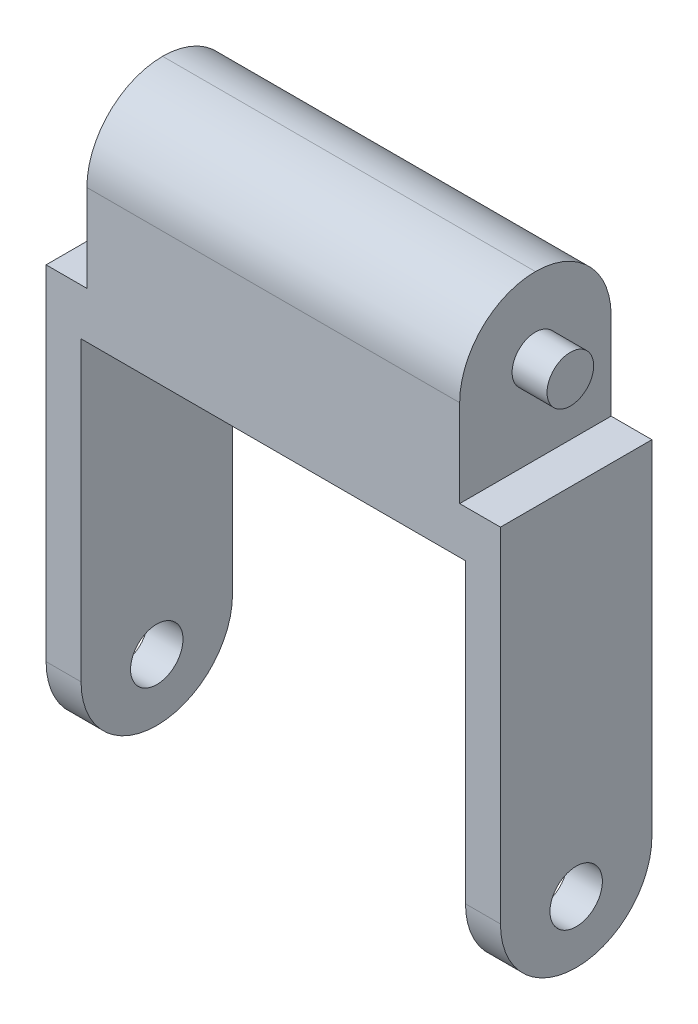
ISO-10303-21;
HEADER;
FILE_DESCRIPTION(('STEP AP214'),'2;1');
FILE_NAME('part.step','',(''),(''),'','','');
FILE_SCHEMA(('AUTOMOTIVE_DESIGN { 1 0 10303 214 1 1 1 1 }'));
ENDSEC;
DATA;
#1=APPLICATION_CONTEXT('core data for automotive mechanical design processes');
#2=APPLICATION_PROTOCOL_DEFINITION('international standard','automotive_design',2000,#1);
#3=PRODUCT_CONTEXT('',#1,'mechanical');
#4=PRODUCT('Part','Part','',(#3));
#5=PRODUCT_RELATED_PRODUCT_CATEGORY('part','',(#4));
#6=PRODUCT_DEFINITION_FORMATION('','',#4);
#7=PRODUCT_DEFINITION_CONTEXT('part definition',#1,'design');
#8=PRODUCT_DEFINITION('design','',#6,#7);
#9=PRODUCT_DEFINITION_SHAPE('','',#8);
#10=(LENGTH_UNIT() NAMED_UNIT(*) SI_UNIT(.MILLI.,.METRE.));
#11=(NAMED_UNIT(*) PLANE_ANGLE_UNIT() SI_UNIT($,.RADIAN.));
#12=(NAMED_UNIT(*) SI_UNIT($,.STERADIAN.) SOLID_ANGLE_UNIT());
#13=UNCERTAINTY_MEASURE_WITH_UNIT(LENGTH_MEASURE(1.E-05),#10,'distance_accuracy_value','');
#14=(GEOMETRIC_REPRESENTATION_CONTEXT(3) GLOBAL_UNCERTAINTY_ASSIGNED_CONTEXT((#13)) GLOBAL_UNIT_ASSIGNED_CONTEXT((#10,
#11,#12)) REPRESENTATION_CONTEXT('',''));
#15=CARTESIAN_POINT('',(0.,0.,0.));
#16=DIRECTION('',(0.,0.,1.));
#17=DIRECTION('',(1.,0.,0.));
#18=AXIS2_PLACEMENT_3D('',#15,#16,#17);
#19=CARTESIAN_POINT('',(0.,0.,13.));
#20=DIRECTION('',(1.,0.,0.));
#21=DIRECTION('',(0.,0.,-1.));
#22=AXIS2_PLACEMENT_3D('',#19,#20,#21);
#23=PLANE('',#22);
#24=CARTESIAN_POINT('',(0.,5.29398853892159,6.5));
#25=DIRECTION('',(-1.,0.,0.));
#26=DIRECTION('',(0.,0.,1.));
#27=AXIS2_PLACEMENT_3D('',#24,#25,#26);
#28=CIRCLE('',#27,2.25);
#29=CARTESIAN_POINT('',(0.,5.29398853892159,8.75));
#30=VERTEX_POINT('',#29);
#31=EDGE_CURVE('E346',#30,#30,#28,.T.);
#32=ORIENTED_EDGE('',*,*,#31,.F.);
#33=EDGE_LOOP('',(#32));
#34=FACE_BOUND('',#33,.T.);
#35=DIRECTION('',(0.,-1.,0.));
#36=VECTOR('',#35,1.);
#37=CARTESIAN_POINT('',(0.,0.,0.));
#38=LINE('',#37,#36);
#39=CARTESIAN_POINT('',(0.,36.,0.));
#40=VERTEX_POINT('',#39);
#41=CARTESIAN_POINT('',(0.,6.5,0.));
#42=VERTEX_POINT('',#41);
#43=EDGE_CURVE('E184',#40,#42,#38,.T.);
#44=ORIENTED_EDGE('',*,*,#43,.T.);
#45=CARTESIAN_POINT('',(0.,6.5,6.5));
#46=DIRECTION('',(1.,0.,0.));
#47=DIRECTION('',(0.,0.,-1.));
#48=AXIS2_PLACEMENT_3D('',#45,#46,#47);
#49=CIRCLE('',#48,6.5);
#50=CARTESIAN_POINT('',(0.,0.,6.5));
#51=VERTEX_POINT('',#50);
#52=EDGE_CURVE('E233',#42,#51,#49,.F.);
#53=ORIENTED_EDGE('',*,*,#52,.T.);
#54=CARTESIAN_POINT('',(0.,6.5,6.5));
#55=DIRECTION('',(1.,0.,0.));
#56=DIRECTION('',(0.,0.,-1.));
#57=AXIS2_PLACEMENT_3D('',#54,#55,#56);
#58=CIRCLE('',#57,6.5);
#59=CARTESIAN_POINT('',(0.,6.5,13.));
#60=VERTEX_POINT('',#59);
#61=EDGE_CURVE('E231',#51,#60,#58,.F.);
#62=ORIENTED_EDGE('',*,*,#61,.T.);
#63=DIRECTION('',(0.,-1.,0.));
#64=VECTOR('',#63,1.);
#65=CARTESIAN_POINT('',(0.,0.,13.));
#66=LINE('',#65,#64);
#67=CARTESIAN_POINT('',(0.,36.,13.));
#68=VERTEX_POINT('',#67);
#69=EDGE_CURVE('E153',#68,#60,#66,.T.);
#70=ORIENTED_EDGE('',*,*,#69,.F.);
#71=DIRECTION('',(0.,0.,-1.));
#72=VECTOR('',#71,1.);
#73=CARTESIAN_POINT('',(0.,36.,13.));
#74=LINE('',#73,#72);
#75=EDGE_CURVE('E183',#68,#40,#74,.T.);
#76=ORIENTED_EDGE('',*,*,#75,.T.);
#77=EDGE_LOOP('',(#44,#53,#62,#70,#76));
#78=FACE_BOUND('',#77,.T.);
#79=ADVANCED_FACE('F33',(#34,#78),#23,.F.);
#80=CARTESIAN_POINT('',(3.,0.,13.));
#81=DIRECTION('',(-1.,0.,0.));
#82=DIRECTION('',(0.,0.,1.));
#83=AXIS2_PLACEMENT_3D('',#80,#81,#82);
#84=PLANE('',#83);
#85=CARTESIAN_POINT('',(3.,5.29398853892159,6.5));
#86=DIRECTION('',(-1.,0.,0.));
#87=DIRECTION('',(0.,0.,1.));
#88=AXIS2_PLACEMENT_3D('',#85,#86,#87);
#89=CIRCLE('',#88,2.25);
#90=CARTESIAN_POINT('',(3.,5.29398853892159,8.75));
#91=VERTEX_POINT('',#90);
#92=EDGE_CURVE('E187',#91,#91,#89,.T.);
#93=ORIENTED_EDGE('',*,*,#92,.T.);
#94=EDGE_LOOP('',(#93));
#95=FACE_BOUND('',#94,.T.);
#96=CARTESIAN_POINT('',(3.,6.5,6.5));
#97=DIRECTION('',(-1.,0.,0.));
#98=DIRECTION('',(0.,0.,1.));
#99=AXIS2_PLACEMENT_3D('',#96,#97,#98);
#100=CIRCLE('',#99,6.5);
#101=CARTESIAN_POINT('',(3.,6.5,13.));
#102=VERTEX_POINT('',#101);
#103=CARTESIAN_POINT('',(3.,0.,6.5));
#104=VERTEX_POINT('',#103);
#105=EDGE_CURVE('E221',#102,#104,#100,.F.);
#106=ORIENTED_EDGE('',*,*,#105,.T.);
#107=CARTESIAN_POINT('',(3.,6.5,6.5));
#108=DIRECTION('',(-1.,0.,0.));
#109=DIRECTION('',(0.,0.,1.));
#110=AXIS2_PLACEMENT_3D('',#107,#108,#109);
#111=CIRCLE('',#110,6.5);
#112=CARTESIAN_POINT('',(3.,6.5,0.));
#113=VERTEX_POINT('',#112);
#114=EDGE_CURVE('E223',#104,#113,#111,.F.);
#115=ORIENTED_EDGE('',*,*,#114,.T.);
#116=DIRECTION('',(0.,1.,0.));
#117=VECTOR('',#116,1.);
#118=CARTESIAN_POINT('',(3.,0.,0.));
#119=LINE('',#118,#117);
#120=CARTESIAN_POINT('',(3.,32.,0.));
#121=VERTEX_POINT('',#120);
#122=EDGE_CURVE('E159',#113,#121,#119,.T.);
#123=ORIENTED_EDGE('',*,*,#122,.T.);
#124=DIRECTION('',(0.,0.,-1.));
#125=VECTOR('',#124,1.);
#126=CARTESIAN_POINT('',(3.,32.,13.));
#127=LINE('',#126,#125);
#128=CARTESIAN_POINT('',(3.,32.,13.));
#129=VERTEX_POINT('',#128);
#130=EDGE_CURVE('E156',#129,#121,#127,.T.);
#131=ORIENTED_EDGE('',*,*,#130,.F.);
#132=DIRECTION('',(0.,1.,0.));
#133=VECTOR('',#132,1.);
#134=CARTESIAN_POINT('',(3.,0.,13.));
#135=LINE('',#134,#133);
#136=EDGE_CURVE('E140',#102,#129,#135,.T.);
#137=ORIENTED_EDGE('',*,*,#136,.F.);
#138=EDGE_LOOP('',(#106,#115,#123,#131,#137));
#139=FACE_BOUND('',#138,.T.);
#140=ADVANCED_FACE('F157',(#95,#139),#84,.F.);
#141=CARTESIAN_POINT('',(3.,32.,13.));
#142=DIRECTION('',(0.,1.,0.));
#143=DIRECTION('',(0.,0.,1.));
#144=AXIS2_PLACEMENT_3D('',#141,#142,#143);
#145=PLANE('',#144);
#146=DIRECTION('',(1.,0.,0.));
#147=VECTOR('',#146,1.);
#148=CARTESIAN_POINT('',(3.,32.,0.));
#149=LINE('',#148,#147);
#150=CARTESIAN_POINT('',(36.,32.,0.));
#151=VERTEX_POINT('',#150);
#152=EDGE_CURVE('E189',#121,#151,#149,.T.);
#153=ORIENTED_EDGE('',*,*,#152,.T.);
#154=DIRECTION('',(0.,0.,-1.));
#155=VECTOR('',#154,1.);
#156=CARTESIAN_POINT('',(36.,32.,13.));
#157=LINE('',#156,#155);
#158=CARTESIAN_POINT('',(36.,32.,13.));
#159=VERTEX_POINT('',#158);
#160=EDGE_CURVE('E163',#159,#151,#157,.T.);
#161=ORIENTED_EDGE('',*,*,#160,.F.);
#162=DIRECTION('',(1.,0.,0.));
#163=VECTOR('',#162,1.);
#164=CARTESIAN_POINT('',(3.,32.,13.));
#165=LINE('',#164,#163);
#166=EDGE_CURVE('E146',#129,#159,#165,.T.);
#167=ORIENTED_EDGE('',*,*,#166,.F.);
#168=ORIENTED_EDGE('',*,*,#130,.T.);
#169=EDGE_LOOP('',(#153,#161,#167,#168));
#170=FACE_BOUND('',#169,.T.);
#171=ADVANCED_FACE('F165',(#170),#145,.F.);
#172=CARTESIAN_POINT('',(36.,32.,13.));
#173=DIRECTION('',(1.,0.,0.));
#174=DIRECTION('',(0.,1.,0.));
#175=AXIS2_PLACEMENT_3D('',#172,#173,#174);
#176=PLANE('',#175);
#177=CARTESIAN_POINT('',(36.,5.29398853892159,6.5));
#178=DIRECTION('',(1.,0.,0.));
#179=DIRECTION('',(0.,1.,0.));
#180=AXIS2_PLACEMENT_3D('',#177,#178,#179);
#181=CIRCLE('',#180,2.25);
#182=CARTESIAN_POINT('',(36.,7.54398853892159,6.5));
#183=VERTEX_POINT('',#182);
#184=EDGE_CURVE('E342',#183,#183,#181,.T.);
#185=ORIENTED_EDGE('',*,*,#184,.T.);
#186=EDGE_LOOP('',(#185));
#187=FACE_BOUND('',#186,.T.);
#188=DIRECTION('',(0.,-1.,0.));
#189=VECTOR('',#188,1.);
#190=CARTESIAN_POINT('',(36.,32.,0.));
#191=LINE('',#190,#189);
#192=CARTESIAN_POINT('',(36.,6.5,0.));
#193=VERTEX_POINT('',#192);
#194=EDGE_CURVE('E191',#151,#193,#191,.T.);
#195=ORIENTED_EDGE('',*,*,#194,.T.);
#196=CARTESIAN_POINT('',(36.,6.5,6.5));
#197=DIRECTION('',(1.,0.,0.));
#198=DIRECTION('',(0.,1.,0.));
#199=AXIS2_PLACEMENT_3D('',#196,#197,#198);
#200=CIRCLE('',#199,6.5);
#201=CARTESIAN_POINT('',(36.,0.,6.5));
#202=VERTEX_POINT('',#201);
#203=EDGE_CURVE('E244',#193,#202,#200,.F.);
#204=ORIENTED_EDGE('',*,*,#203,.T.);
#205=CARTESIAN_POINT('',(36.,6.5,6.5));
#206=DIRECTION('',(1.,0.,0.));
#207=DIRECTION('',(0.,1.,0.));
#208=AXIS2_PLACEMENT_3D('',#205,#206,#207);
#209=CIRCLE('',#208,6.5);
#210=CARTESIAN_POINT('',(36.,6.5,13.));
#211=VERTEX_POINT('',#210);
#212=EDGE_CURVE('E242',#202,#211,#209,.F.);
#213=ORIENTED_EDGE('',*,*,#212,.T.);
#214=DIRECTION('',(0.,-1.,0.));
#215=VECTOR('',#214,1.);
#216=CARTESIAN_POINT('',(36.,32.,13.));
#217=LINE('',#216,#215);
#218=EDGE_CURVE('E168',#159,#211,#217,.T.);
#219=ORIENTED_EDGE('',*,*,#218,.F.);
#220=ORIENTED_EDGE('',*,*,#160,.T.);
#221=EDGE_LOOP('',(#195,#204,#213,#219,#220));
#222=FACE_BOUND('',#221,.T.);
#223=ADVANCED_FACE('F327',(#187,#222),#176,.F.);
#224=CARTESIAN_POINT('',(39.,0.,13.));
#225=DIRECTION('',(-1.,0.,0.));
#226=DIRECTION('',(0.,0.,1.));
#227=AXIS2_PLACEMENT_3D('',#224,#225,#226);
#228=PLANE('',#227);
#229=CARTESIAN_POINT('',(39.,5.29398853892159,6.5));
#230=DIRECTION('',(-1.,0.,0.));
#231=DIRECTION('',(0.,0.,1.));
#232=AXIS2_PLACEMENT_3D('',#229,#230,#231);
#233=CIRCLE('',#232,2.25);
#234=CARTESIAN_POINT('',(39.,5.29398853892159,8.75));
#235=VERTEX_POINT('',#234);
#236=EDGE_CURVE('E345',#235,#235,#233,.T.);
#237=ORIENTED_EDGE('',*,*,#236,.T.);
#238=EDGE_LOOP('',(#237));
#239=FACE_BOUND('',#238,.T.);
#240=CARTESIAN_POINT('',(39.,6.5,6.5));
#241=DIRECTION('',(-1.,0.,0.));
#242=DIRECTION('',(0.,0.,1.));
#243=AXIS2_PLACEMENT_3D('',#240,#241,#242);
#244=CIRCLE('',#243,6.5);
#245=CARTESIAN_POINT('',(39.,6.5,13.));
#246=VERTEX_POINT('',#245);
#247=CARTESIAN_POINT('',(39.,0.,6.5));
#248=VERTEX_POINT('',#247);
#249=EDGE_CURVE('E238',#246,#248,#244,.F.);
#250=ORIENTED_EDGE('',*,*,#249,.T.);
#251=CARTESIAN_POINT('',(39.,6.5,6.5));
#252=DIRECTION('',(-1.,0.,0.));
#253=DIRECTION('',(0.,0.,1.));
#254=AXIS2_PLACEMENT_3D('',#251,#252,#253);
#255=CIRCLE('',#254,6.5);
#256=CARTESIAN_POINT('',(39.,6.5,0.));
#257=VERTEX_POINT('',#256);
#258=EDGE_CURVE('E240',#248,#257,#255,.F.);
#259=ORIENTED_EDGE('',*,*,#258,.T.);
#260=DIRECTION('',(0.,1.,0.));
#261=VECTOR('',#260,1.);
#262=CARTESIAN_POINT('',(39.,0.,0.));
#263=LINE('',#262,#261);
#264=CARTESIAN_POINT('',(39.,36.,0.));
#265=VERTEX_POINT('',#264);
#266=EDGE_CURVE('E194',#257,#265,#263,.T.);
#267=ORIENTED_EDGE('',*,*,#266,.T.);
#268=DIRECTION('',(0.,0.,-1.));
#269=VECTOR('',#268,1.);
#270=CARTESIAN_POINT('',(39.,36.,13.));
#271=LINE('',#270,#269);
#272=CARTESIAN_POINT('',(39.,36.,13.));
#273=VERTEX_POINT('',#272);
#274=EDGE_CURVE('E212',#273,#265,#271,.T.);
#275=ORIENTED_EDGE('',*,*,#274,.F.);
#276=DIRECTION('',(0.,1.,0.));
#277=VECTOR('',#276,1.);
#278=CARTESIAN_POINT('',(39.,0.,13.));
#279=LINE('',#278,#277);
#280=EDGE_CURVE('E170',#246,#273,#279,.T.);
#281=ORIENTED_EDGE('',*,*,#280,.F.);
#282=EDGE_LOOP('',(#250,#259,#267,#275,#281));
#283=FACE_BOUND('',#282,.T.);
#284=ADVANCED_FACE('F317',(#239,#283),#228,.F.);
#285=CARTESIAN_POINT('',(35.5,36.,13.));
#286=DIRECTION('',(0.,-1.,0.));
#287=DIRECTION('',(0.,0.,-1.));
#288=AXIS2_PLACEMENT_3D('',#285,#286,#287);
#289=PLANE('',#288);
#290=DIRECTION('',(-1.,0.,0.));
#291=VECTOR('',#290,1.);
#292=CARTESIAN_POINT('',(35.5,36.,0.));
#293=LINE('',#292,#291);
#294=CARTESIAN_POINT('',(35.5,36.,0.));
#295=VERTEX_POINT('',#294);
#296=EDGE_CURVE('E196',#265,#295,#293,.T.);
#297=ORIENTED_EDGE('',*,*,#296,.T.);
#298=DIRECTION('',(0.,0.,-1.));
#299=VECTOR('',#298,1.);
#300=CARTESIAN_POINT('',(35.5,36.,13.));
#301=LINE('',#300,#299);
#302=CARTESIAN_POINT('',(35.5,36.,13.));
#303=VERTEX_POINT('',#302);
#304=EDGE_CURVE('E209',#303,#295,#301,.T.);
#305=ORIENTED_EDGE('',*,*,#304,.F.);
#306=DIRECTION('',(-1.,0.,0.));
#307=VECTOR('',#306,1.);
#308=CARTESIAN_POINT('',(35.5,36.,13.));
#309=LINE('',#308,#307);
#310=EDGE_CURVE('E175',#273,#303,#309,.T.);
#311=ORIENTED_EDGE('',*,*,#310,.F.);
#312=ORIENTED_EDGE('',*,*,#274,.T.);
#313=EDGE_LOOP('',(#297,#305,#311,#312));
#314=FACE_BOUND('',#313,.T.);
#315=ADVANCED_FACE('F321',(#314),#289,.F.);
#316=CARTESIAN_POINT('',(35.5,50.,13.));
#317=DIRECTION('',(-1.,0.,0.));
#318=DIRECTION('',(0.,0.,1.));
#319=AXIS2_PLACEMENT_3D('',#316,#317,#318);
#320=PLANE('',#319);
#321=CARTESIAN_POINT('',(35.5,43.5,6.5));
#322=DIRECTION('',(-1.,0.,0.));
#323=DIRECTION('',(0.,0.,1.));
#324=AXIS2_PLACEMENT_3D('',#321,#322,#323);
#325=CIRCLE('',#324,2.);
#326=CARTESIAN_POINT('',(35.5,43.5,8.5));
#327=VERTEX_POINT('',#326);
#328=EDGE_CURVE('E218',#327,#327,#325,.F.);
#329=ORIENTED_EDGE('',*,*,#328,.F.);
#330=EDGE_LOOP('',(#329));
#331=FACE_BOUND('',#330,.T.);
#332=CARTESIAN_POINT('',(35.5,43.5,6.5));
#333=DIRECTION('',(-1.,0.,0.));
#334=DIRECTION('',(0.,0.,1.));
#335=AXIS2_PLACEMENT_3D('',#332,#333,#334);
#336=CIRCLE('',#335,6.5);
#337=CARTESIAN_POINT('',(35.5,43.5,0.));
#338=VERTEX_POINT('',#337);
#339=CARTESIAN_POINT('',(35.5,50.,6.5));
#340=VERTEX_POINT('',#339);
#341=EDGE_CURVE('E49',#338,#340,#336,.F.);
#342=ORIENTED_EDGE('',*,*,#341,.T.);
#343=CARTESIAN_POINT('',(35.5,43.5,6.5));
#344=DIRECTION('',(-1.,0.,0.));
#345=DIRECTION('',(0.,0.,1.));
#346=AXIS2_PLACEMENT_3D('',#343,#344,#345);
#347=CIRCLE('',#346,6.5);
#348=CARTESIAN_POINT('',(35.5,43.5,13.));
#349=VERTEX_POINT('',#348);
#350=EDGE_CURVE('E42',#340,#349,#347,.F.);
#351=ORIENTED_EDGE('',*,*,#350,.T.);
#352=DIRECTION('',(0.,1.,0.));
#353=VECTOR('',#352,1.);
#354=CARTESIAN_POINT('',(35.5,50.,13.));
#355=LINE('',#354,#353);
#356=EDGE_CURVE('E177',#303,#349,#355,.T.);
#357=ORIENTED_EDGE('',*,*,#356,.F.);
#358=ORIENTED_EDGE('',*,*,#304,.T.);
#359=DIRECTION('',(0.,1.,0.));
#360=VECTOR('',#359,1.);
#361=CARTESIAN_POINT('',(35.5,50.,0.));
#362=LINE('',#361,#360);
#363=EDGE_CURVE('E198',#295,#338,#362,.T.);
#364=ORIENTED_EDGE('',*,*,#363,.T.);
#365=EDGE_LOOP('',(#342,#351,#357,#358,#364));
#366=FACE_BOUND('',#365,.T.);
#367=ADVANCED_FACE('F263',(#331,#366),#320,.F.);
#368=CARTESIAN_POINT('',(3.49999999999999,36.,13.));
#369=DIRECTION('',(1.,0.,0.));
#370=DIRECTION('',(0.,0.,-1.));
#371=AXIS2_PLACEMENT_3D('',#368,#369,#370);
#372=PLANE('',#371);
#373=CARTESIAN_POINT('',(3.49999999999999,43.5,6.5));
#374=DIRECTION('',(1.,0.,0.));
#375=DIRECTION('',(0.,0.,-1.));
#376=AXIS2_PLACEMENT_3D('',#373,#374,#375);
#377=CIRCLE('',#376,2.);
#378=CARTESIAN_POINT('',(3.49999999999999,43.5,4.5));
#379=VERTEX_POINT('',#378);
#380=EDGE_CURVE('E162',#379,#379,#377,.F.);
#381=ORIENTED_EDGE('',*,*,#380,.F.);
#382=EDGE_LOOP('',(#381));
#383=FACE_BOUND('',#382,.T.);
#384=DIRECTION('',(0.,-1.,0.));
#385=VECTOR('',#384,1.);
#386=CARTESIAN_POINT('',(3.49999999999999,36.,13.));
#387=LINE('',#386,#385);
#388=CARTESIAN_POINT('',(3.49999999999999,43.5,13.));
#389=VERTEX_POINT('',#388);
#390=CARTESIAN_POINT('',(3.49999999999999,36.,13.));
#391=VERTEX_POINT('',#390);
#392=EDGE_CURVE('E179',#389,#391,#387,.T.);
#393=ORIENTED_EDGE('',*,*,#392,.F.);
#394=CARTESIAN_POINT('',(3.49999999999999,43.5,6.5));
#395=DIRECTION('',(1.,0.,0.));
#396=DIRECTION('',(0.,0.,-1.));
#397=AXIS2_PLACEMENT_3D('',#394,#395,#396);
#398=CIRCLE('',#397,6.5);
#399=CARTESIAN_POINT('',(3.49999999999999,50.,6.5));
#400=VERTEX_POINT('',#399);
#401=EDGE_CURVE('E258',#389,#400,#398,.F.);
#402=ORIENTED_EDGE('',*,*,#401,.T.);
#403=CARTESIAN_POINT('',(3.49999999999999,43.5,6.5));
#404=DIRECTION('',(1.,0.,0.));
#405=DIRECTION('',(0.,0.,-1.));
#406=AXIS2_PLACEMENT_3D('',#403,#404,#405);
#407=CIRCLE('',#406,6.5);
#408=CARTESIAN_POINT('',(3.49999999999999,43.5,0.));
#409=VERTEX_POINT('',#408);
#410=EDGE_CURVE('E256',#400,#409,#407,.F.);
#411=ORIENTED_EDGE('',*,*,#410,.T.);
#412=DIRECTION('',(0.,-1.,0.));
#413=VECTOR('',#412,1.);
#414=CARTESIAN_POINT('',(3.49999999999999,36.,0.));
#415=LINE('',#414,#413);
#416=CARTESIAN_POINT('',(3.49999999999999,36.,0.));
#417=VERTEX_POINT('',#416);
#418=EDGE_CURVE('E200',#409,#417,#415,.T.);
#419=ORIENTED_EDGE('',*,*,#418,.T.);
#420=DIRECTION('',(0.,0.,-1.));
#421=VECTOR('',#420,1.);
#422=CARTESIAN_POINT('',(3.49999999999999,36.,13.));
#423=LINE('',#422,#421);
#424=EDGE_CURVE('E206',#391,#417,#423,.T.);
#425=ORIENTED_EDGE('',*,*,#424,.F.);
#426=EDGE_LOOP('',(#393,#402,#411,#419,#425));
#427=FACE_BOUND('',#426,.T.);
#428=ADVANCED_FACE('F273',(#383,#427),#372,.F.);
#429=CARTESIAN_POINT('',(0.,36.,13.));
#430=DIRECTION('',(0.,-1.,0.));
#431=DIRECTION('',(0.,0.,-1.));
#432=AXIS2_PLACEMENT_3D('',#429,#430,#431);
#433=PLANE('',#432);
#434=DIRECTION('',(-1.,0.,0.));
#435=VECTOR('',#434,1.);
#436=CARTESIAN_POINT('',(0.,36.,0.));
#437=LINE('',#436,#435);
#438=EDGE_CURVE('E202',#417,#40,#437,.T.);
#439=ORIENTED_EDGE('',*,*,#438,.T.);
#440=ORIENTED_EDGE('',*,*,#75,.F.);
#441=DIRECTION('',(-1.,0.,0.));
#442=VECTOR('',#441,1.);
#443=CARTESIAN_POINT('',(0.,36.,13.));
#444=LINE('',#443,#442);
#445=EDGE_CURVE('E181',#391,#68,#444,.T.);
#446=ORIENTED_EDGE('',*,*,#445,.F.);
#447=ORIENTED_EDGE('',*,*,#424,.T.);
#448=EDGE_LOOP('',(#439,#440,#446,#447));
#449=FACE_BOUND('',#448,.T.);
#450=ADVANCED_FACE('F337',(#449),#433,.F.);
#451=CARTESIAN_POINT('',(0.,0.,13.));
#452=DIRECTION('',(0.,0.,-1.));
#453=DIRECTION('',(-1.,0.,0.));
#454=AXIS2_PLACEMENT_3D('',#451,#452,#453);
#455=PLANE('',#454);
#456=ORIENTED_EDGE('',*,*,#356,.T.);
#457=DIRECTION('',(-1.,0.,0.));
#458=VECTOR('',#457,1.);
#459=CARTESIAN_POINT('',(0.,43.5,13.));
#460=LINE('',#459,#458);
#461=EDGE_CURVE('E246',#349,#389,#460,.T.);
#462=ORIENTED_EDGE('',*,*,#461,.T.);
#463=ORIENTED_EDGE('',*,*,#392,.T.);
#464=ORIENTED_EDGE('',*,*,#445,.T.);
#465=ORIENTED_EDGE('',*,*,#69,.T.);
#466=DIRECTION('',(1.,0.,0.));
#467=VECTOR('',#466,1.);
#468=CARTESIAN_POINT('',(0.,6.5,13.));
#469=LINE('',#468,#467);
#470=EDGE_CURVE('E150',#60,#102,#469,.T.);
#471=ORIENTED_EDGE('',*,*,#470,.T.);
#472=ORIENTED_EDGE('',*,*,#136,.T.);
#473=ORIENTED_EDGE('',*,*,#166,.T.);
#474=ORIENTED_EDGE('',*,*,#218,.T.);
#475=DIRECTION('',(1.,0.,0.));
#476=VECTOR('',#475,1.);
#477=CARTESIAN_POINT('',(0.,6.5,13.));
#478=LINE('',#477,#476);
#479=EDGE_CURVE('E235',#211,#246,#478,.T.);
#480=ORIENTED_EDGE('',*,*,#479,.T.);
#481=ORIENTED_EDGE('',*,*,#280,.T.);
#482=ORIENTED_EDGE('',*,*,#310,.T.);
#483=EDGE_LOOP('',(#456,#462,#463,#464,#465,#471,#472,#473,#474,#480,#481,#482));
#484=FACE_BOUND('',#483,.T.);
#485=ADVANCED_FACE('F143',(#484),#455,.F.);
#486=CARTESIAN_POINT('',(0.,0.,0.));
#487=DIRECTION('',(0.,0.,-1.));
#488=DIRECTION('',(-1.,0.,0.));
#489=AXIS2_PLACEMENT_3D('',#486,#487,#488);
#490=PLANE('',#489);
#491=ORIENTED_EDGE('',*,*,#418,.F.);
#492=DIRECTION('',(-1.,0.,0.));
#493=VECTOR('',#492,1.);
#494=CARTESIAN_POINT('',(35.5,43.5,0.));
#495=LINE('',#494,#493);
#496=EDGE_CURVE('E11',#409,#338,#495,.F.);
#497=ORIENTED_EDGE('',*,*,#496,.T.);
#498=ORIENTED_EDGE('',*,*,#363,.F.);
#499=ORIENTED_EDGE('',*,*,#296,.F.);
#500=ORIENTED_EDGE('',*,*,#266,.F.);
#501=DIRECTION('',(1.,0.,0.));
#502=VECTOR('',#501,1.);
#503=CARTESIAN_POINT('',(36.,6.5,0.));
#504=LINE('',#503,#502);
#505=EDGE_CURVE('E225',#257,#193,#504,.F.);
#506=ORIENTED_EDGE('',*,*,#505,.T.);
#507=ORIENTED_EDGE('',*,*,#194,.F.);
#508=ORIENTED_EDGE('',*,*,#152,.F.);
#509=ORIENTED_EDGE('',*,*,#122,.F.);
#510=DIRECTION('',(1.,0.,0.));
#511=VECTOR('',#510,1.);
#512=CARTESIAN_POINT('',(0.,6.5,0.));
#513=LINE('',#512,#511);
#514=EDGE_CURVE('E228',#113,#42,#513,.F.);
#515=ORIENTED_EDGE('',*,*,#514,.T.);
#516=ORIENTED_EDGE('',*,*,#43,.F.);
#517=ORIENTED_EDGE('',*,*,#438,.F.);
#518=EDGE_LOOP('',(#491,#497,#498,#499,#500,#506,#507,#508,#509,#515,#516,#517));
#519=FACE_BOUND('',#518,.T.);
#520=ADVANCED_FACE('F322',(#519),#490,.T.);
#521=CARTESIAN_POINT('',(39.,5.29398853892159,6.5));
#522=DIRECTION('',(-1.,0.,0.));
#523=DIRECTION('',(0.,0.,1.));
#524=AXIS2_PLACEMENT_3D('',#521,#522,#523);
#525=CYLINDRICAL_SURFACE('',#524,2.25);
#526=ORIENTED_EDGE('',*,*,#236,.F.);
#527=EDGE_LOOP('',(#526));
#528=FACE_BOUND('',#527,.T.);
#529=ORIENTED_EDGE('',*,*,#184,.F.);
#530=EDGE_LOOP('',(#529));
#531=FACE_BOUND('',#530,.T.);
#532=ADVANCED_FACE('F415',(#528,#531),#525,.F.);
#533=ORIENTED_EDGE('',*,*,#31,.T.);
#534=EDGE_LOOP('',(#533));
#535=FACE_BOUND('',#534,.T.);
#536=ORIENTED_EDGE('',*,*,#92,.F.);
#537=EDGE_LOOP('',(#536));
#538=FACE_BOUND('',#537,.T.);
#539=ADVANCED_FACE('F420',(#535,#538),#525,.F.);
#540=CARTESIAN_POINT('',(0.499999999999994,43.5,6.5));
#541=DIRECTION('',(1.,0.,0.));
#542=DIRECTION('',(0.,0.,-1.));
#543=AXIS2_PLACEMENT_3D('',#540,#541,#542);
#544=CYLINDRICAL_SURFACE('',#543,2.);
#545=CARTESIAN_POINT('',(0.499999999999994,43.5,6.5));
#546=DIRECTION('',(-1.,0.,0.));
#547=DIRECTION('',(0.,0.,1.));
#548=AXIS2_PLACEMENT_3D('',#545,#546,#547);
#549=CIRCLE('',#548,2.);
#550=CARTESIAN_POINT('',(0.499999999999994,43.5,8.5));
#551=VERTEX_POINT('',#550);
#552=EDGE_CURVE('E349',#551,#551,#549,.T.);
#553=ORIENTED_EDGE('',*,*,#552,.F.);
#554=EDGE_LOOP('',(#553));
#555=FACE_BOUND('',#554,.T.);
#556=ORIENTED_EDGE('',*,*,#380,.T.);
#557=EDGE_LOOP('',(#556));
#558=FACE_BOUND('',#557,.T.);
#559=ADVANCED_FACE('F432',(#555,#558),#544,.T.);
#560=CARTESIAN_POINT('',(0.499999999999994,43.5,6.5));
#561=DIRECTION('',(-1.,0.,0.));
#562=DIRECTION('',(0.,0.,1.));
#563=AXIS2_PLACEMENT_3D('',#560,#561,#562);
#564=PLANE('',#563);
#565=ORIENTED_EDGE('',*,*,#552,.T.);
#566=EDGE_LOOP('',(#565));
#567=FACE_BOUND('',#566,.T.);
#568=ADVANCED_FACE('F361',(#567),#564,.T.);
#569=CARTESIAN_POINT('',(38.5,43.5,6.5));
#570=DIRECTION('',(-1.,0.,0.));
#571=DIRECTION('',(0.,-1.,0.));
#572=AXIS2_PLACEMENT_3D('',#569,#570,#571);
#573=CYLINDRICAL_SURFACE('',#572,2.);
#574=CARTESIAN_POINT('',(38.5,43.5,6.5));
#575=DIRECTION('',(1.,0.,0.));
#576=DIRECTION('',(0.,1.,0.));
#577=AXIS2_PLACEMENT_3D('',#574,#575,#576);
#578=CIRCLE('',#577,2.);
#579=CARTESIAN_POINT('',(38.5,45.5,6.5));
#580=VERTEX_POINT('',#579);
#581=EDGE_CURVE('E250',#580,#580,#578,.T.);
#582=ORIENTED_EDGE('',*,*,#581,.F.);
#583=EDGE_LOOP('',(#582));
#584=FACE_BOUND('',#583,.T.);
#585=ORIENTED_EDGE('',*,*,#328,.T.);
#586=EDGE_LOOP('',(#585));
#587=FACE_BOUND('',#586,.T.);
#588=ADVANCED_FACE('F358',(#584,#587),#573,.T.);
#589=CARTESIAN_POINT('',(38.5,43.5,6.5));
#590=DIRECTION('',(1.,0.,0.));
#591=DIRECTION('',(0.,1.,0.));
#592=AXIS2_PLACEMENT_3D('',#589,#590,#591);
#593=PLANE('',#592);
#594=ORIENTED_EDGE('',*,*,#581,.T.);
#595=EDGE_LOOP('',(#594));
#596=FACE_BOUND('',#595,.T.);
#597=ADVANCED_FACE('F303',(#596),#593,.T.);
#598=CARTESIAN_POINT('',(0.,6.5,6.5));
#599=DIRECTION('',(1.,0.,0.));
#600=DIRECTION('',(0.,0.,-1.));
#601=AXIS2_PLACEMENT_3D('',#598,#599,#600);
#602=CYLINDRICAL_SURFACE('',#601,6.5);
#603=ORIENTED_EDGE('',*,*,#470,.F.);
#604=ORIENTED_EDGE('',*,*,#61,.F.);
#605=DIRECTION('',(1.,0.,0.));
#606=VECTOR('',#605,1.);
#607=CARTESIAN_POINT('',(0.,0.,6.5));
#608=LINE('',#607,#606);
#609=EDGE_CURVE('E247',#104,#51,#608,.F.);
#610=ORIENTED_EDGE('',*,*,#609,.F.);
#611=ORIENTED_EDGE('',*,*,#105,.F.);
#612=EDGE_LOOP('',(#603,#604,#610,#611));
#613=FACE_BOUND('',#612,.T.);
#614=ADVANCED_FACE('F300',(#613),#602,.T.);
#615=CARTESIAN_POINT('',(0.,6.5,6.5));
#616=DIRECTION('',(-1.,0.,0.));
#617=DIRECTION('',(0.,0.,1.));
#618=AXIS2_PLACEMENT_3D('',#615,#616,#617);
#619=CYLINDRICAL_SURFACE('',#618,6.5);
#620=ORIENTED_EDGE('',*,*,#52,.F.);
#621=ORIENTED_EDGE('',*,*,#514,.F.);
#622=ORIENTED_EDGE('',*,*,#114,.F.);
#623=ORIENTED_EDGE('',*,*,#609,.T.);
#624=EDGE_LOOP('',(#620,#621,#622,#623));
#625=FACE_BOUND('',#624,.T.);
#626=ADVANCED_FACE('F297',(#625),#619,.T.);
#627=CARTESIAN_POINT('',(0.,6.5,6.5));
#628=DIRECTION('',(1.,0.,0.));
#629=DIRECTION('',(0.,0.,-1.));
#630=AXIS2_PLACEMENT_3D('',#627,#628,#629);
#631=CYLINDRICAL_SURFACE('',#630,6.5);
#632=ORIENTED_EDGE('',*,*,#479,.F.);
#633=ORIENTED_EDGE('',*,*,#212,.F.);
#634=DIRECTION('',(1.,0.,0.));
#635=VECTOR('',#634,1.);
#636=CARTESIAN_POINT('',(36.,0.,6.5));
#637=LINE('',#636,#635);
#638=EDGE_CURVE('E251',#248,#202,#637,.F.);
#639=ORIENTED_EDGE('',*,*,#638,.F.);
#640=ORIENTED_EDGE('',*,*,#249,.F.);
#641=EDGE_LOOP('',(#632,#633,#639,#640));
#642=FACE_BOUND('',#641,.T.);
#643=ADVANCED_FACE('F282',(#642),#631,.T.);
#644=CARTESIAN_POINT('',(36.,6.5,6.5));
#645=DIRECTION('',(-1.,0.,0.));
#646=DIRECTION('',(0.,0.,1.));
#647=AXIS2_PLACEMENT_3D('',#644,#645,#646);
#648=CYLINDRICAL_SURFACE('',#647,6.5);
#649=ORIENTED_EDGE('',*,*,#203,.F.);
#650=ORIENTED_EDGE('',*,*,#505,.F.);
#651=ORIENTED_EDGE('',*,*,#258,.F.);
#652=ORIENTED_EDGE('',*,*,#638,.T.);
#653=EDGE_LOOP('',(#649,#650,#651,#652));
#654=FACE_BOUND('',#653,.T.);
#655=ADVANCED_FACE('F277',(#654),#648,.T.);
#656=CARTESIAN_POINT('',(3.49999999999999,43.5,6.5));
#657=DIRECTION('',(1.,0.,0.));
#658=DIRECTION('',(0.,0.,-1.));
#659=AXIS2_PLACEMENT_3D('',#656,#657,#658);
#660=CYLINDRICAL_SURFACE('',#659,6.5);
#661=DIRECTION('',(-1.,0.,0.));
#662=VECTOR('',#661,1.);
#663=CARTESIAN_POINT('',(3.49999999999999,50.,6.5));
#664=LINE('',#663,#662);
#665=EDGE_CURVE('E37',#340,#400,#664,.T.);
#666=ORIENTED_EDGE('',*,*,#665,.F.);
#667=ORIENTED_EDGE('',*,*,#341,.F.);
#668=ORIENTED_EDGE('',*,*,#496,.F.);
#669=ORIENTED_EDGE('',*,*,#410,.F.);
#670=EDGE_LOOP('',(#666,#667,#668,#669));
#671=FACE_BOUND('',#670,.T.);
#672=ADVANCED_FACE('F35',(#671),#660,.T.);
#673=CARTESIAN_POINT('',(0.,43.5,6.5));
#674=DIRECTION('',(-1.,0.,0.));
#675=DIRECTION('',(0.,0.,1.));
#676=AXIS2_PLACEMENT_3D('',#673,#674,#675);
#677=CYLINDRICAL_SURFACE('',#676,6.5);
#678=ORIENTED_EDGE('',*,*,#350,.F.);
#679=ORIENTED_EDGE('',*,*,#665,.T.);
#680=ORIENTED_EDGE('',*,*,#401,.F.);
#681=ORIENTED_EDGE('',*,*,#461,.F.);
#682=EDGE_LOOP('',(#678,#679,#680,#681));
#683=FACE_BOUND('',#682,.T.);
#684=ADVANCED_FACE('F270',(#683),#677,.T.);
#685=CLOSED_SHELL('',(#79,#140,#171,#223,#284,#315,#367,#428,#450,#485,#520,#532,#539,#559,#568,
#588,#597,#614,#626,#643,#655,#672,#684));
#686=MANIFOLD_SOLID_BREP('B2',#685);
#687=ADVANCED_BREP_SHAPE_REPRESENTATION('',(#18,#686),#14);
#688=SHAPE_DEFINITION_REPRESENTATION(#9,#687);
ENDSEC;
END-ISO-10303-21;
